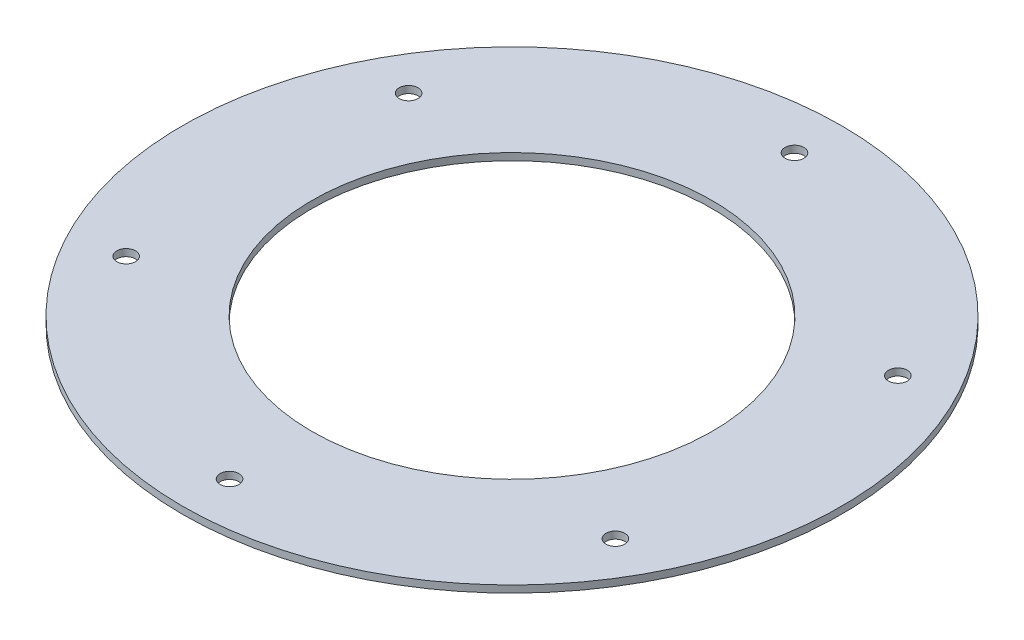
ISO-10303-21;
HEADER;
FILE_DESCRIPTION(('STEP AP214'),'2;1');
FILE_NAME('part.step','',(''),(''),'','','');
FILE_SCHEMA(('AUTOMOTIVE_DESIGN { 1 0 10303 214 1 1 1 1 }'));
ENDSEC;
DATA;
#1=APPLICATION_CONTEXT('core data for automotive mechanical design processes');
#2=APPLICATION_PROTOCOL_DEFINITION('international standard','automotive_design',2000,#1);
#3=PRODUCT_CONTEXT('',#1,'mechanical');
#4=PRODUCT('Part','Part','',(#3));
#5=PRODUCT_RELATED_PRODUCT_CATEGORY('part','',(#4));
#6=PRODUCT_DEFINITION_FORMATION('','',#4);
#7=PRODUCT_DEFINITION_CONTEXT('part definition',#1,'design');
#8=PRODUCT_DEFINITION('design','',#6,#7);
#9=PRODUCT_DEFINITION_SHAPE('','',#8);
#10=(LENGTH_UNIT() NAMED_UNIT(*) SI_UNIT(.MILLI.,.METRE.));
#11=(NAMED_UNIT(*) PLANE_ANGLE_UNIT() SI_UNIT($,.RADIAN.));
#12=(NAMED_UNIT(*) SI_UNIT($,.STERADIAN.) SOLID_ANGLE_UNIT());
#13=UNCERTAINTY_MEASURE_WITH_UNIT(LENGTH_MEASURE(1.E-05),#10,'distance_accuracy_value','');
#14=(GEOMETRIC_REPRESENTATION_CONTEXT(3) GLOBAL_UNCERTAINTY_ASSIGNED_CONTEXT((#13)) GLOBAL_UNIT_ASSIGNED_CONTEXT((#10,
#11,#12)) REPRESENTATION_CONTEXT('',''));
#15=CARTESIAN_POINT('',(0.,0.,0.));
#16=DIRECTION('',(0.,0.,1.));
#17=DIRECTION('',(1.,0.,0.));
#18=AXIS2_PLACEMENT_3D('',#15,#16,#17);
#19=CARTESIAN_POINT('',(0.,3.,0.));
#20=DIRECTION('',(0.,1.,0.));
#21=DIRECTION('',(0.,0.,1.));
#22=AXIS2_PLACEMENT_3D('',#19,#20,#21);
#23=PLANE('',#22);
#24=CARTESIAN_POINT('',(-103.923048454129,3.,-59.999999999994));
#25=DIRECTION('',(0.,1.,0.));
#26=DIRECTION('',(0.,0.,1.));
#27=AXIS2_PLACEMENT_3D('',#24,#25,#26);
#28=CIRCLE('',#27,4.00000000000641);
#29=CARTESIAN_POINT('',(-103.923048454129,3.,-55.9999999999876));
#30=VERTEX_POINT('',#29);
#31=EDGE_CURVE('E80',#30,#30,#28,.T.);
#32=ORIENTED_EDGE('',*,*,#31,.F.);
#33=EDGE_LOOP('',(#32));
#34=FACE_BOUND('',#33,.T.);
#35=CARTESIAN_POINT('',(-103.923048454122,3.,60.0000000000059));
#36=DIRECTION('',(0.,1.,0.));
#37=DIRECTION('',(0.,0.,1.));
#38=AXIS2_PLACEMENT_3D('',#35,#36,#37);
#39=CIRCLE('',#38,4.00000000001263);
#40=CARTESIAN_POINT('',(-103.923048454122,3.,64.0000000000186));
#41=VERTEX_POINT('',#40);
#42=EDGE_CURVE('E74',#41,#41,#39,.T.);
#43=ORIENTED_EDGE('',*,*,#42,.F.);
#44=EDGE_LOOP('',(#43));
#45=FACE_BOUND('',#44,.T.);
#46=CARTESIAN_POINT('',(1.36130290034144E-11,3.,120.));
#47=DIRECTION('',(0.,1.,0.));
#48=DIRECTION('',(0.,0.,1.));
#49=AXIS2_PLACEMENT_3D('',#46,#47,#48);
#50=CIRCLE('',#49,4.00000000001382);
#51=CARTESIAN_POINT('',(1.36130290034144E-11,3.,124.000000000014));
#52=VERTEX_POINT('',#51);
#53=EDGE_CURVE('E68',#52,#52,#50,.T.);
#54=ORIENTED_EDGE('',*,*,#53,.F.);
#55=EDGE_LOOP('',(#54));
#56=FACE_BOUND('',#55,.T.);
#57=CARTESIAN_POINT('',(103.923048454143,3.,59.9999999999941));
#58=DIRECTION('',(0.,1.,0.));
#59=DIRECTION('',(0.,0.,1.));
#60=AXIS2_PLACEMENT_3D('',#57,#58,#59);
#61=CIRCLE('',#60,4.00000000000861);
#62=CARTESIAN_POINT('',(103.923048454143,3.,64.0000000000027));
#63=VERTEX_POINT('',#62);
#64=EDGE_CURVE('E62',#63,#63,#61,.T.);
#65=ORIENTED_EDGE('',*,*,#64,.F.);
#66=EDGE_LOOP('',(#65));
#67=FACE_BOUND('',#66,.T.);
#68=CARTESIAN_POINT('',(103.923048454136,3.,-60.0000000000059));
#69=DIRECTION('',(0.,1.,0.));
#70=DIRECTION('',(0.,0.,1.));
#71=AXIS2_PLACEMENT_3D('',#68,#69,#70);
#72=CIRCLE('',#71,4.00000000000183);
#73=CARTESIAN_POINT('',(103.923048454136,3.,-56.0000000000041));
#74=VERTEX_POINT('',#73);
#75=EDGE_CURVE('E56',#74,#74,#72,.T.);
#76=ORIENTED_EDGE('',*,*,#75,.F.);
#77=EDGE_LOOP('',(#76));
#78=FACE_BOUND('',#77,.T.);
#79=CARTESIAN_POINT('',(0.,3.,-120.));
#80=DIRECTION('',(0.,1.,0.));
#81=DIRECTION('',(0.,0.,1.));
#82=AXIS2_PLACEMENT_3D('',#79,#80,#81);
#83=CIRCLE('',#82,4.);
#84=CARTESIAN_POINT('',(0.,3.,-116.));
#85=VERTEX_POINT('',#84);
#86=EDGE_CURVE('E50',#85,#85,#83,.T.);
#87=ORIENTED_EDGE('',*,*,#86,.F.);
#88=EDGE_LOOP('',(#87));
#89=FACE_BOUND('',#88,.T.);
#90=CARTESIAN_POINT('',(0.,3.,0.));
#91=DIRECTION('',(0.,1.,0.));
#92=DIRECTION('',(0.,0.,1.));
#93=AXIS2_PLACEMENT_3D('',#90,#91,#92);
#94=CIRCLE('',#93,140.);
#95=CARTESIAN_POINT('',(0.,3.,140.));
#96=VERTEX_POINT('',#95);
#97=EDGE_CURVE('E10',#96,#96,#94,.T.);
#98=ORIENTED_EDGE('',*,*,#97,.T.);
#99=EDGE_LOOP('',(#98));
#100=FACE_BOUND('',#99,.T.);
#101=CARTESIAN_POINT('',(0.,3.,0.));
#102=DIRECTION('',(0.,1.,0.));
#103=DIRECTION('',(0.,0.,1.));
#104=AXIS2_PLACEMENT_3D('',#101,#102,#103);
#105=CIRCLE('',#104,85.);
#106=CARTESIAN_POINT('',(0.,3.,85.));
#107=VERTEX_POINT('',#106);
#108=EDGE_CURVE('E42',#107,#107,#105,.T.);
#109=ORIENTED_EDGE('',*,*,#108,.F.);
#110=EDGE_LOOP('',(#109));
#111=FACE_BOUND('',#110,.T.);
#112=ADVANCED_FACE('F31',(#34,#45,#56,#67,#78,#89,#100,#111),#23,.T.);
#113=CARTESIAN_POINT('',(0.,0.,0.));
#114=DIRECTION('',(0.,1.,0.));
#115=DIRECTION('',(0.,0.,1.));
#116=AXIS2_PLACEMENT_3D('',#113,#114,#115);
#117=PLANE('',#116);
#118=CARTESIAN_POINT('',(-103.923048454129,0.,-59.999999999994));
#119=DIRECTION('',(0.,1.,0.));
#120=DIRECTION('',(0.,0.,1.));
#121=AXIS2_PLACEMENT_3D('',#118,#119,#120);
#122=CIRCLE('',#121,4.00000000000641);
#123=CARTESIAN_POINT('',(-103.923048454129,0.,-55.9999999999876));
#124=VERTEX_POINT('',#123);
#125=EDGE_CURVE('E77',#124,#124,#122,.T.);
#126=ORIENTED_EDGE('',*,*,#125,.T.);
#127=EDGE_LOOP('',(#126));
#128=FACE_BOUND('',#127,.T.);
#129=CARTESIAN_POINT('',(-103.923048454122,0.,60.0000000000059));
#130=DIRECTION('',(0.,1.,0.));
#131=DIRECTION('',(0.,0.,1.));
#132=AXIS2_PLACEMENT_3D('',#129,#130,#131);
#133=CIRCLE('',#132,4.00000000001263);
#134=CARTESIAN_POINT('',(-103.923048454122,0.,64.0000000000186));
#135=VERTEX_POINT('',#134);
#136=EDGE_CURVE('E71',#135,#135,#133,.T.);
#137=ORIENTED_EDGE('',*,*,#136,.T.);
#138=EDGE_LOOP('',(#137));
#139=FACE_BOUND('',#138,.T.);
#140=CARTESIAN_POINT('',(1.36130290034144E-11,0.,120.));
#141=DIRECTION('',(0.,1.,0.));
#142=DIRECTION('',(0.,0.,1.));
#143=AXIS2_PLACEMENT_3D('',#140,#141,#142);
#144=CIRCLE('',#143,4.00000000001382);
#145=CARTESIAN_POINT('',(1.36130290034144E-11,0.,124.000000000014));
#146=VERTEX_POINT('',#145);
#147=EDGE_CURVE('E65',#146,#146,#144,.T.);
#148=ORIENTED_EDGE('',*,*,#147,.T.);
#149=EDGE_LOOP('',(#148));
#150=FACE_BOUND('',#149,.T.);
#151=CARTESIAN_POINT('',(103.923048454143,0.,59.9999999999941));
#152=DIRECTION('',(0.,1.,0.));
#153=DIRECTION('',(0.,0.,1.));
#154=AXIS2_PLACEMENT_3D('',#151,#152,#153);
#155=CIRCLE('',#154,4.00000000000861);
#156=CARTESIAN_POINT('',(103.923048454143,0.,64.0000000000027));
#157=VERTEX_POINT('',#156);
#158=EDGE_CURVE('E59',#157,#157,#155,.T.);
#159=ORIENTED_EDGE('',*,*,#158,.T.);
#160=EDGE_LOOP('',(#159));
#161=FACE_BOUND('',#160,.T.);
#162=CARTESIAN_POINT('',(103.923048454136,0.,-60.0000000000059));
#163=DIRECTION('',(0.,1.,0.));
#164=DIRECTION('',(0.,0.,1.));
#165=AXIS2_PLACEMENT_3D('',#162,#163,#164);
#166=CIRCLE('',#165,4.00000000000183);
#167=CARTESIAN_POINT('',(103.923048454136,0.,-56.0000000000041));
#168=VERTEX_POINT('',#167);
#169=EDGE_CURVE('E53',#168,#168,#166,.T.);
#170=ORIENTED_EDGE('',*,*,#169,.T.);
#171=EDGE_LOOP('',(#170));
#172=FACE_BOUND('',#171,.T.);
#173=CARTESIAN_POINT('',(0.,0.,-120.));
#174=DIRECTION('',(0.,1.,0.));
#175=DIRECTION('',(0.,0.,1.));
#176=AXIS2_PLACEMENT_3D('',#173,#174,#175);
#177=CIRCLE('',#176,4.);
#178=CARTESIAN_POINT('',(0.,0.,-116.));
#179=VERTEX_POINT('',#178);
#180=EDGE_CURVE('E47',#179,#179,#177,.T.);
#181=ORIENTED_EDGE('',*,*,#180,.T.);
#182=EDGE_LOOP('',(#181));
#183=FACE_BOUND('',#182,.T.);
#184=CARTESIAN_POINT('',(0.,0.,0.));
#185=DIRECTION('',(0.,1.,0.));
#186=DIRECTION('',(0.,0.,1.));
#187=AXIS2_PLACEMENT_3D('',#184,#185,#186);
#188=CIRCLE('',#187,140.);
#189=CARTESIAN_POINT('',(0.,0.,140.));
#190=VERTEX_POINT('',#189);
#191=EDGE_CURVE('E35',#190,#190,#188,.T.);
#192=ORIENTED_EDGE('',*,*,#191,.F.);
#193=EDGE_LOOP('',(#192));
#194=FACE_BOUND('',#193,.T.);
#195=CARTESIAN_POINT('',(0.,0.,0.));
#196=DIRECTION('',(0.,1.,0.));
#197=DIRECTION('',(0.,0.,1.));
#198=AXIS2_PLACEMENT_3D('',#195,#196,#197);
#199=CIRCLE('',#198,85.);
#200=CARTESIAN_POINT('',(0.,0.,85.));
#201=VERTEX_POINT('',#200);
#202=EDGE_CURVE('E44',#201,#201,#199,.T.);
#203=ORIENTED_EDGE('',*,*,#202,.T.);
#204=EDGE_LOOP('',(#203));
#205=FACE_BOUND('',#204,.T.);
#206=ADVANCED_FACE('F86',(#128,#139,#150,#161,#172,#183,#194,#205),#117,.F.);
#207=CARTESIAN_POINT('',(0.,3.,0.));
#208=DIRECTION('',(0.,-1.,0.));
#209=DIRECTION('',(0.,0.,-1.));
#210=AXIS2_PLACEMENT_3D('',#207,#208,#209);
#211=CYLINDRICAL_SURFACE('',#210,140.);
#212=ORIENTED_EDGE('',*,*,#97,.F.);
#213=EDGE_LOOP('',(#212));
#214=FACE_BOUND('',#213,.T.);
#215=ORIENTED_EDGE('',*,*,#191,.T.);
#216=EDGE_LOOP('',(#215));
#217=FACE_BOUND('',#216,.T.);
#218=ADVANCED_FACE('F33',(#214,#217),#211,.T.);
#219=CARTESIAN_POINT('',(0.,3.,0.));
#220=DIRECTION('',(0.,-1.,0.));
#221=DIRECTION('',(0.,0.,-1.));
#222=AXIS2_PLACEMENT_3D('',#219,#220,#221);
#223=CYLINDRICAL_SURFACE('',#222,85.);
#224=ORIENTED_EDGE('',*,*,#108,.T.);
#225=EDGE_LOOP('',(#224));
#226=FACE_BOUND('',#225,.T.);
#227=ORIENTED_EDGE('',*,*,#202,.F.);
#228=EDGE_LOOP('',(#227));
#229=FACE_BOUND('',#228,.T.);
#230=ADVANCED_FACE('F111',(#226,#229),#223,.F.);
#231=CARTESIAN_POINT('',(0.,0.,-120.));
#232=DIRECTION('',(0.,1.,0.));
#233=DIRECTION('',(0.,0.,1.));
#234=AXIS2_PLACEMENT_3D('',#231,#232,#233);
#235=CYLINDRICAL_SURFACE('',#234,4.);
#236=ORIENTED_EDGE('',*,*,#180,.F.);
#237=EDGE_LOOP('',(#236));
#238=FACE_BOUND('',#237,.T.);
#239=ORIENTED_EDGE('',*,*,#86,.T.);
#240=EDGE_LOOP('',(#239));
#241=FACE_BOUND('',#240,.T.);
#242=ADVANCED_FACE('F114',(#238,#241),#235,.F.);
#243=CARTESIAN_POINT('',(103.923048454136,0.,-60.0000000000059));
#244=DIRECTION('',(0.,1.,0.));
#245=DIRECTION('',(0.,0.,1.));
#246=AXIS2_PLACEMENT_3D('',#243,#244,#245);
#247=CYLINDRICAL_SURFACE('',#246,4.00000000000183);
#248=ORIENTED_EDGE('',*,*,#169,.F.);
#249=EDGE_LOOP('',(#248));
#250=FACE_BOUND('',#249,.T.);
#251=ORIENTED_EDGE('',*,*,#75,.T.);
#252=EDGE_LOOP('',(#251));
#253=FACE_BOUND('',#252,.T.);
#254=ADVANCED_FACE('F126',(#250,#253),#247,.F.);
#255=CARTESIAN_POINT('',(103.923048454143,0.,59.9999999999941));
#256=DIRECTION('',(0.,1.,0.));
#257=DIRECTION('',(0.,0.,1.));
#258=AXIS2_PLACEMENT_3D('',#255,#256,#257);
#259=CYLINDRICAL_SURFACE('',#258,4.00000000000861);
#260=ORIENTED_EDGE('',*,*,#158,.F.);
#261=EDGE_LOOP('',(#260));
#262=FACE_BOUND('',#261,.T.);
#263=ORIENTED_EDGE('',*,*,#64,.T.);
#264=EDGE_LOOP('',(#263));
#265=FACE_BOUND('',#264,.T.);
#266=ADVANCED_FACE('F130',(#262,#265),#259,.F.);
#267=CARTESIAN_POINT('',(1.36130290034144E-11,0.,120.));
#268=DIRECTION('',(0.,1.,0.));
#269=DIRECTION('',(0.,0.,1.));
#270=AXIS2_PLACEMENT_3D('',#267,#268,#269);
#271=CYLINDRICAL_SURFACE('',#270,4.00000000001382);
#272=ORIENTED_EDGE('',*,*,#147,.F.);
#273=EDGE_LOOP('',(#272));
#274=FACE_BOUND('',#273,.T.);
#275=ORIENTED_EDGE('',*,*,#53,.T.);
#276=EDGE_LOOP('',(#275));
#277=FACE_BOUND('',#276,.T.);
#278=ADVANCED_FACE('F134',(#274,#277),#271,.F.);
#279=CARTESIAN_POINT('',(-103.923048454122,0.,60.0000000000059));
#280=DIRECTION('',(0.,1.,0.));
#281=DIRECTION('',(0.,0.,1.));
#282=AXIS2_PLACEMENT_3D('',#279,#280,#281);
#283=CYLINDRICAL_SURFACE('',#282,4.00000000001263);
#284=ORIENTED_EDGE('',*,*,#136,.F.);
#285=EDGE_LOOP('',(#284));
#286=FACE_BOUND('',#285,.T.);
#287=ORIENTED_EDGE('',*,*,#42,.T.);
#288=EDGE_LOOP('',(#287));
#289=FACE_BOUND('',#288,.T.);
#290=ADVANCED_FACE('F92',(#286,#289),#283,.F.);
#291=CARTESIAN_POINT('',(-103.923048454129,0.,-59.999999999994));
#292=DIRECTION('',(0.,1.,0.));
#293=DIRECTION('',(0.,0.,1.));
#294=AXIS2_PLACEMENT_3D('',#291,#292,#293);
#295=CYLINDRICAL_SURFACE('',#294,4.00000000000641);
#296=ORIENTED_EDGE('',*,*,#125,.F.);
#297=EDGE_LOOP('',(#296));
#298=FACE_BOUND('',#297,.T.);
#299=ORIENTED_EDGE('',*,*,#31,.T.);
#300=EDGE_LOOP('',(#299));
#301=FACE_BOUND('',#300,.T.);
#302=ADVANCED_FACE('F89',(#298,#301),#295,.F.);
#303=CLOSED_SHELL('',(#112,#206,#218,#230,#242,#254,#266,#278,#290,#302));
#304=MANIFOLD_SOLID_BREP('B2',#303);
#305=ADVANCED_BREP_SHAPE_REPRESENTATION('',(#18,#304),#14);
#306=SHAPE_DEFINITION_REPRESENTATION(#9,#305);
ENDSEC;
END-ISO-10303-21;
